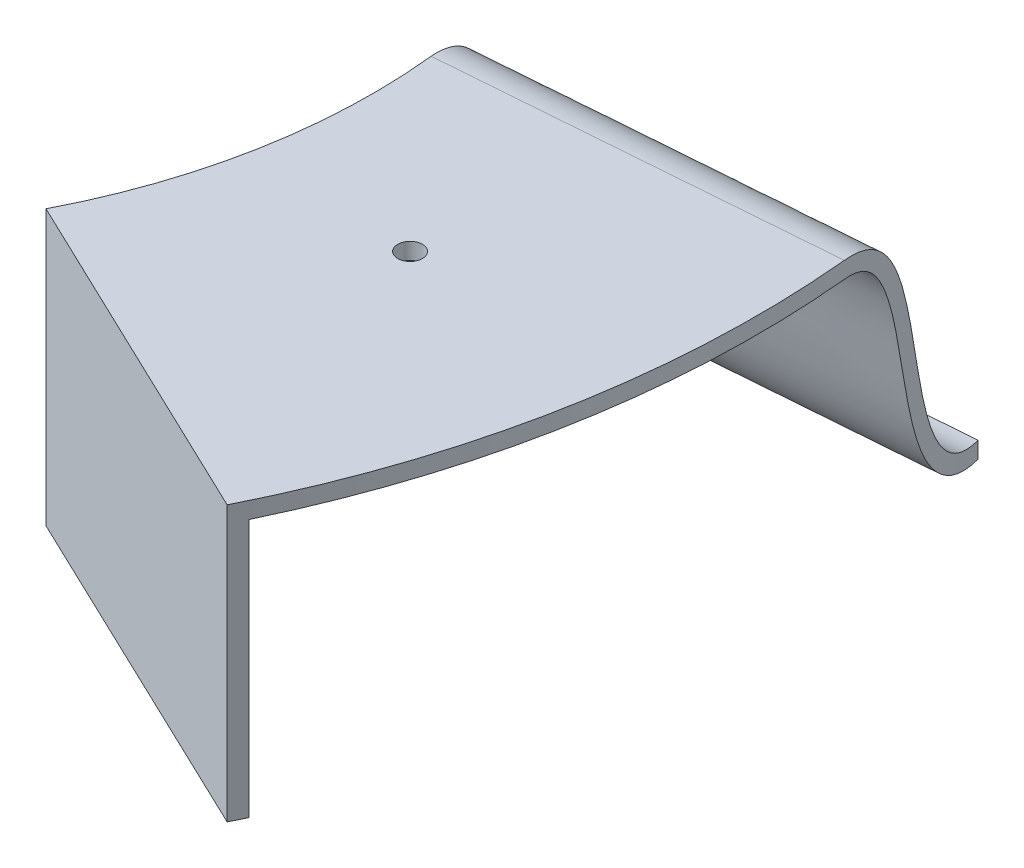
ISO-10303-21;
HEADER;
FILE_DESCRIPTION(('STEP AP214'),'2;1');
FILE_NAME('part.step','',(''),(''),'','','');
FILE_SCHEMA(('AUTOMOTIVE_DESIGN { 1 0 10303 214 1 1 1 1 }'));
ENDSEC;
DATA;
#1=APPLICATION_CONTEXT('core data for automotive mechanical design processes');
#2=APPLICATION_PROTOCOL_DEFINITION('international standard','automotive_design',2000,#1);
#3=PRODUCT_CONTEXT('',#1,'mechanical');
#4=PRODUCT('Part','Part','',(#3));
#5=PRODUCT_RELATED_PRODUCT_CATEGORY('part','',(#4));
#6=PRODUCT_DEFINITION_FORMATION('','',#4);
#7=PRODUCT_DEFINITION_CONTEXT('part definition',#1,'design');
#8=PRODUCT_DEFINITION('design','',#6,#7);
#9=PRODUCT_DEFINITION_SHAPE('','',#8);
#10=(LENGTH_UNIT() NAMED_UNIT(*) SI_UNIT(.MILLI.,.METRE.));
#11=(NAMED_UNIT(*) PLANE_ANGLE_UNIT() SI_UNIT($,.RADIAN.));
#12=(NAMED_UNIT(*) SI_UNIT($,.STERADIAN.) SOLID_ANGLE_UNIT());
#13=UNCERTAINTY_MEASURE_WITH_UNIT(LENGTH_MEASURE(1.E-05),#10,'distance_accuracy_value','');
#14=(GEOMETRIC_REPRESENTATION_CONTEXT(3) GLOBAL_UNCERTAINTY_ASSIGNED_CONTEXT((#13)) GLOBAL_UNIT_ASSIGNED_CONTEXT((#10,
#11,#12)) REPRESENTATION_CONTEXT('',''));
#15=CARTESIAN_POINT('',(0.,0.,0.));
#16=DIRECTION('',(0.,0.,1.));
#17=DIRECTION('',(1.,0.,0.));
#18=AXIS2_PLACEMENT_3D('',#15,#16,#17);
#19=CARTESIAN_POINT('',(0.,-60.,0.));
#20=DIRECTION('',(0.,1.,0.));
#21=DIRECTION('',(0.,0.,1.));
#22=AXIS2_PLACEMENT_3D('',#19,#20,#21);
#23=CYLINDRICAL_SURFACE('',#22,108.);
#24=CARTESIAN_POINT('',(0.,-60.,0.));
#25=DIRECTION('',(0.,1.,0.));
#26=DIRECTION('',(0.,0.,1.));
#27=AXIS2_PLACEMENT_3D('',#24,#25,#26);
#28=CIRCLE('',#27,108.);
#29=CARTESIAN_POINT('',(97.4441274393781,-60.,46.5686807584051));
#30=VERTEX_POINT('',#29);
#31=CARTESIAN_POINT('',(107.398759189683,-60.,-11.3800933439276));
#32=VERTEX_POINT('',#31);
#33=EDGE_CURVE('E174',#30,#32,#28,.T.);
#34=ORIENTED_EDGE('',*,*,#33,.T.);
#35=DIRECTION('',(0.,-1.,0.));
#36=VECTOR('',#35,1.);
#37=CARTESIAN_POINT('',(107.398759189683,-9.99999999999999,-11.3800933439276));
#38=LINE('',#37,#36);
#39=CARTESIAN_POINT('',(107.398759189683,-13.,-11.3800933439276));
#40=VERTEX_POINT('',#39);
#41=EDGE_CURVE('E162',#40,#32,#38,.T.);
#42=ORIENTED_EDGE('',*,*,#41,.F.);
#43=CARTESIAN_POINT('',(0.,-13.,0.));
#44=DIRECTION('',(0.,1.,0.));
#45=DIRECTION('',(0.,0.,1.));
#46=AXIS2_PLACEMENT_3D('',#43,#44,#45);
#47=CIRCLE('',#46,108.);
#48=CARTESIAN_POINT('',(97.4441274393781,-13.,46.5686807584051));
#49=VERTEX_POINT('',#48);
#50=EDGE_CURVE('E173',#49,#40,#47,.T.);
#51=ORIENTED_EDGE('',*,*,#50,.F.);
#52=DIRECTION('',(0.,1.,0.));
#53=VECTOR('',#52,1.);
#54=CARTESIAN_POINT('',(97.4441274393781,-60.,46.5686807584051));
#55=LINE('',#54,#53);
#56=EDGE_CURVE('E198',#30,#49,#55,.T.);
#57=ORIENTED_EDGE('',*,*,#56,.F.);
#58=EDGE_LOOP('',(#34,#42,#51,#57));
#59=FACE_BOUND('',#58,.T.);
#60=ADVANCED_FACE('F39',(#59),#23,.T.);
#61=CARTESIAN_POINT('',(0.,-60.,0.));
#62=DIRECTION('',(-0.431191488503751,0.,0.902260439253501));
#63=DIRECTION('',(0.902260439253501,0.,0.431191488503751));
#64=AXIS2_PLACEMENT_3D('',#61,#62,#63);
#65=PLANE('',#64);
#66=DIRECTION('',(-0.902260439253501,0.,-0.431191488503751));
#67=VECTOR('',#66,1.);
#68=CARTESIAN_POINT('',(0.,-13.,0.));
#69=LINE('',#68,#67);
#70=CARTESIAN_POINT('',(157.895576869363,-13.,75.4585104881564));
#71=VERTEX_POINT('',#70);
#72=EDGE_CURVE('E170',#71,#49,#69,.T.);
#73=ORIENTED_EDGE('',*,*,#72,.F.);
#74=DIRECTION('',(0.,1.,0.));
#75=VECTOR('',#74,1.);
#76=CARTESIAN_POINT('',(157.895576869363,-60.,75.4585104881564));
#77=LINE('',#76,#75);
#78=CARTESIAN_POINT('',(157.895576869363,-60.,75.4585104881564));
#79=VERTEX_POINT('',#78);
#80=EDGE_CURVE('E202',#79,#71,#77,.T.);
#81=ORIENTED_EDGE('',*,*,#80,.F.);
#82=DIRECTION('',(0.902260439253501,0.,0.431191488503751));
#83=VECTOR('',#82,1.);
#84=CARTESIAN_POINT('',(0.,-60.,0.));
#85=LINE('',#84,#83);
#86=EDGE_CURVE('E189',#30,#79,#85,.T.);
#87=ORIENTED_EDGE('',*,*,#86,.F.);
#88=ORIENTED_EDGE('',*,*,#56,.T.);
#89=EDGE_LOOP('',(#73,#81,#87,#88));
#90=FACE_BOUND('',#89,.T.);
#91=ADVANCED_FACE('F245',(#90),#65,.F.);
#92=CARTESIAN_POINT('',(0.,-60.,0.));
#93=DIRECTION('',(0.,1.,0.));
#94=DIRECTION('',(0.,0.,1.));
#95=AXIS2_PLACEMENT_3D('',#92,#93,#94);
#96=CYLINDRICAL_SURFACE('',#95,175.);
#97=CARTESIAN_POINT('',(0.,-10.,0.));
#98=DIRECTION('',(0.,1.,0.));
#99=DIRECTION('',(0.,0.,1.));
#100=AXIS2_PLACEMENT_3D('',#97,#98,#99);
#101=CIRCLE('',#100,175.);
#102=CARTESIAN_POINT('',(156.578799716315,-10.,78.1542032100517));
#103=VERTEX_POINT('',#102);
#104=CARTESIAN_POINT('',(174.212075233309,-10.,-16.5877316985724));
#105=VERTEX_POINT('',#104);
#106=EDGE_CURVE('E178',#103,#105,#101,.T.);
#107=ORIENTED_EDGE('',*,*,#106,.F.);
#108=DIRECTION('',(0.,1.,0.));
#109=VECTOR('',#108,1.);
#110=CARTESIAN_POINT('',(156.578799716315,-60.,78.1542032100517));
#111=LINE('',#110,#109);
#112=CARTESIAN_POINT('',(156.578799716315,-60.,78.1542032100517));
#113=VERTEX_POINT('',#112);
#114=EDGE_CURVE('E205',#113,#103,#111,.T.);
#115=ORIENTED_EDGE('',*,*,#114,.F.);
#116=CARTESIAN_POINT('',(0.,-60.,0.));
#117=DIRECTION('',(0.,1.,0.));
#118=DIRECTION('',(0.,0.,1.));
#119=AXIS2_PLACEMENT_3D('',#116,#117,#118);
#120=CIRCLE('',#119,175.);
#121=EDGE_CURVE('E186',#113,#79,#120,.T.);
#122=ORIENTED_EDGE('',*,*,#121,.T.);
#123=ORIENTED_EDGE('',*,*,#80,.T.);
#124=CARTESIAN_POINT('',(0.,-13.,0.));
#125=DIRECTION('',(0.,1.,0.));
#126=DIRECTION('',(0.,0.,1.));
#127=AXIS2_PLACEMENT_3D('',#124,#125,#126);
#128=CIRCLE('',#127,175.);
#129=CARTESIAN_POINT('',(174.212075233309,-13.,-16.5877316985724));
#130=VERTEX_POINT('',#129);
#131=EDGE_CURVE('E167',#130,#71,#128,.F.);
#132=ORIENTED_EDGE('',*,*,#131,.F.);
#133=CARTESIAN_POINT('',(168.736054114403,-59.,-46.4019831677623));
#134=CARTESIAN_POINT('',(168.765743413753,-58.9999944229445,-46.2940211639735));
#135=CARTESIAN_POINT('',(168.795328182611,-58.9989412248589,-46.1860337783242));
#136=CARTESIAN_POINT('',(168.854281022557,-58.9947217350341,-45.9700371209772));
#137=CARTESIAN_POINT('',(168.883649085991,-58.9915553690078,-45.8620278486434));
#138=CARTESIAN_POINT('',(168.971508039527,-58.97884619479,-45.5376734168448));
#139=CARTESIAN_POINT('',(169.029657832277,-58.9660932023859,-45.3213502325253));
#140=CARTESIAN_POINT('',(169.144989943779,-58.9313358777362,-44.8890017320752));
#141=CARTESIAN_POINT('',(169.202171457153,-58.909324203219,-44.6729767891598));
#142=CARTESIAN_POINT('',(169.315428879099,-58.8556724226418,-44.2417816179056));
#143=CARTESIAN_POINT('',(169.371504563544,-58.8240303856438,-44.0266115697506));
#144=CARTESIAN_POINT('',(169.482481429487,-58.7508434250989,-43.5974500609822));
#145=CARTESIAN_POINT('',(169.537381565424,-58.7092900548627,-43.3834597658037));
#146=CARTESIAN_POINT('',(169.645821974475,-58.615982374438,-42.9574600603129));
#147=CARTESIAN_POINT('',(169.699362808591,-58.5642323524239,-42.7454498564017));
#148=CARTESIAN_POINT('',(169.804969887496,-58.4502224580249,-42.3239810844225));
#149=CARTESIAN_POINT('',(169.857036668277,-58.3879664646378,-42.1145216050727));
#150=CARTESIAN_POINT('',(169.9595875189,-58.2526831392078,-41.6987346616385));
#151=CARTESIAN_POINT('',(170.010071688205,-58.1796564857224,-41.4924070011504));
#152=CARTESIAN_POINT('',(170.122707943943,-58.0019294576496,-41.0284715690253));
#153=CARTESIAN_POINT('',(170.184352260791,-57.8939898762927,-40.7719739062442));
#154=CARTESIAN_POINT('',(170.304791586222,-57.6613476356402,-40.2659364958718));
#155=CARTESIAN_POINT('',(170.363585888613,-57.5366408502751,-40.0163984792163));
#156=CARTESIAN_POINT('',(170.478161374237,-57.2709664601344,-39.5254353116069));
#157=CARTESIAN_POINT('',(170.533942739079,-57.129999837053,-39.2840096720003));
#158=CARTESIAN_POINT('',(170.642215567656,-56.8328083750086,-38.8109901908186));
#159=CARTESIAN_POINT('',(170.694716140816,-56.6766291754985,-38.5793697598994));
#160=CARTESIAN_POINT('',(170.796493403555,-56.3492627650161,-38.1262610889518));
#161=CARTESIAN_POINT('',(170.845770220405,-56.1780761471457,-37.9047724490351));
#162=CARTESIAN_POINT('',(170.941097234578,-55.8218761074723,-37.4725267551005));
#163=CARTESIAN_POINT('',(170.987147444379,-55.6368627391512,-37.2617696595784));
#164=CARTESIAN_POINT('',(171.104499296366,-55.1320451722014,-36.7201421675965));
#165=CARTESIAN_POINT('',(171.173144404566,-54.8016209948918,-36.398526761172));
#166=CARTESIAN_POINT('',(171.30241679036,-54.1127834998765,-35.7851970569971));
#167=CARTESIAN_POINT('',(171.363042491651,-53.7543647014776,-35.4934886403192));
#168=CARTESIAN_POINT('',(171.477099672368,-53.0136246765197,-34.9383005013085));
#169=CARTESIAN_POINT('',(171.530509027702,-52.6312349805478,-34.6749080737547));
#170=CARTESIAN_POINT('',(171.630695154083,-51.8482331346587,-34.1755671933182));
#171=CARTESIAN_POINT('',(171.677472169646,-51.4476216572448,-33.9396177287514));
#172=CARTESIAN_POINT('',(171.746416384116,-50.807612138955,-33.5884690571207));
#173=CARTESIAN_POINT('',(171.77052103547,-50.5729148852636,-33.4649516651766));
#174=CARTESIAN_POINT('',(171.81704244635,-50.0996163696286,-33.2252741601996));
#175=CARTESIAN_POINT('',(171.839459165449,-49.8610150143426,-33.109114223399));
#176=CARTESIAN_POINT('',(171.882754518314,-49.3802164090303,-32.8836112873878));
#177=CARTESIAN_POINT('',(171.903631731635,-49.1380160798731,-32.7742745976817));
#178=CARTESIAN_POINT('',(171.943943027721,-48.6506679854246,-32.5621266814758));
#179=CARTESIAN_POINT('',(171.96337712669,-48.4055202532628,-32.4593153817103));
#180=CARTESIAN_POINT('',(172.019738087475,-47.6656756101905,-32.1597759073859));
#181=CARTESIAN_POINT('',(172.054676412392,-47.1671089910952,-31.972188830084));
#182=CARTESIAN_POINT('',(172.120146647863,-46.162355335888,-31.6178353200896));
#183=CARTESIAN_POINT('',(172.150677879264,-45.6561671385039,-31.4510720969726));
#184=CARTESIAN_POINT('',(172.20830148355,-44.6354260907734,-31.1340166451233));
#185=CARTESIAN_POINT('',(172.235373925053,-44.1208424776483,-30.9838205077474));
#186=CARTESIAN_POINT('',(172.286600132353,-43.0881286532848,-30.6976952943684));
#187=CARTESIAN_POINT('',(172.31075656031,-42.5700021402919,-30.561753220319));
#188=CARTESIAN_POINT('',(172.356823067899,-41.5310866483851,-30.3008753234559));
#189=CARTESIAN_POINT('',(172.378733876888,-41.0102985919832,-30.1759359289302));
#190=CARTESIAN_POINT('',(172.42076918116,-39.9666899509208,-29.9348176092459));
#191=CARTESIAN_POINT('',(172.440893840165,-39.4438695571442,-29.8186378813027));
#192=CARTESIAN_POINT('',(172.488761950631,-38.1547778753343,-29.5407374122955));
#193=CARTESIAN_POINT('',(172.515727729142,-37.3876702873379,-29.382786230552));
#194=CARTESIAN_POINT('',(172.567898576197,-35.8517154813369,-29.0748125564508));
#195=CARTESIAN_POINT('',(172.593103382362,-35.0828680216411,-28.924791246425));
#196=CARTESIAN_POINT('',(172.642832863669,-33.5446349682105,-28.6264756754857));
#197=CARTESIAN_POINT('',(172.667357378758,-32.7752492907749,-28.478181825676));
#198=CARTESIAN_POINT('',(172.716574127169,-31.2407565130038,-28.1781493063424));
#199=CARTESIAN_POINT('',(172.741265099465,-30.4756458053807,-28.0264292603614));
#200=CARTESIAN_POINT('',(172.779228977755,-29.3296754085066,-27.7910826406198));
#201=CARTESIAN_POINT('',(172.792036872263,-28.948005235257,-27.7113475427688));
#202=CARTESIAN_POINT('',(172.818096708589,-28.1854331390192,-27.5483626105324));
#203=CARTESIAN_POINT('',(172.831348645027,-27.8045312067811,-27.4651128187329));
#204=CARTESIAN_POINT('',(172.858436288177,-27.0438485313169,-27.2941109964043));
#205=CARTESIAN_POINT('',(172.872271858473,-26.6640675480474,-27.2063600169389));
#206=CARTESIAN_POINT('',(172.900688937966,-25.9058957462008,-27.0251767681108));
#207=CARTESIAN_POINT('',(172.915270426491,-25.5275048894106,-26.9317446561746));
#208=CARTESIAN_POINT('',(172.94609958583,-24.7538476586615,-26.7330739624808));
#209=CARTESIAN_POINT('',(172.962394013438,-24.3586739397993,-26.6274797882809));
#210=CARTESIAN_POINT('',(172.996192343236,-23.5709327142297,-26.4070045223429));
#211=CARTESIAN_POINT('',(173.013696327781,-23.1783653869847,-26.292122798144));
#212=CARTESIAN_POINT('',(173.050197229358,-22.3957493737283,-26.0508000878769));
#213=CARTESIAN_POINT('',(173.06919784011,-22.0057096647329,-25.9243303683117));
#214=CARTESIAN_POINT('',(173.108944446199,-21.2304449449107,-25.6575831595461));
#215=CARTESIAN_POINT('',(173.129690336421,-20.8452196457201,-25.5173065018365));
#216=CARTESIAN_POINT('',(173.166092168046,-20.2064357660702,-25.2688479089243));
#217=CARTESIAN_POINT('',(173.181189479885,-19.9510807072629,-25.1652037463426));
#218=CARTESIAN_POINT('',(173.212419501763,-19.4440419798025,-24.9493416139874));
#219=CARTESIAN_POINT('',(173.228552285186,-19.1923585729104,-24.8371230364459));
#220=CARTESIAN_POINT('',(173.261999601331,-18.693592598146,-24.6027136682047));
#221=CARTESIAN_POINT('',(173.27931467093,-18.4465121861918,-24.4805183420654));
#222=CARTESIAN_POINT('',(173.315212312112,-17.9588816474279,-24.2250651722953));
#223=CARTESIAN_POINT('',(173.333792063269,-17.7183185605106,-24.0918318096667));
#224=CARTESIAN_POINT('',(173.372348389261,-17.2447822076046,-23.8127835473512));
#225=CARTESIAN_POINT('',(173.392324519792,-17.0118065616983,-23.6669726461952));
#226=CARTESIAN_POINT('',(173.433789070318,-16.5556519894974,-23.3611777740535));
#227=CARTESIAN_POINT('',(173.455276334648,-16.3324657841743,-23.2012046101794));
#228=CARTESIAN_POINT('',(173.495688386856,-15.9397501817837,-22.8968335293693));
#229=CARTESIAN_POINT('',(173.514329995366,-15.7680517557035,-22.7552058145035));
#230=CARTESIAN_POINT('',(173.552743520778,-15.4350221654548,-22.4603499261895));
#231=CARTESIAN_POINT('',(173.572515286906,-15.273689624449,-22.3071232992675));
#232=CARTESIAN_POINT('',(173.613096871169,-14.9642209217224,-21.9890470867718));
#233=CARTESIAN_POINT('',(173.633902643014,-14.8160388036669,-21.8242419015956));
#234=CARTESIAN_POINT('',(173.676515482071,-14.5344466904292,-21.4824950082557));
#235=CARTESIAN_POINT('',(173.698322543578,-14.4010366111128,-21.3055533692245));
#236=CARTESIAN_POINT('',(173.735485951625,-14.1920898415547,-20.9999111617005));
#237=CARTESIAN_POINT('',(173.750620368123,-14.1118921038662,-20.8743516928376));
#238=CARTESIAN_POINT('',(173.781190606361,-13.9598200821993,-20.618302606383));
#239=CARTESIAN_POINT('',(173.796626443783,-13.8879462326453,-20.4878127319439));
#240=CARTESIAN_POINT('',(173.827696398054,-13.7527868427682,-20.2225074430829));
#241=CARTESIAN_POINT('',(173.84333048664,-13.6895000930139,-20.0876926411097));
#242=CARTESIAN_POINT('',(173.874782232359,-13.5715838871593,-19.8136116915186));
#243=CARTESIAN_POINT('',(173.890600401572,-13.5169952462091,-19.6743280413988));
#244=CARTESIAN_POINT('',(173.922246916261,-13.416746052129,-19.392579190454));
#245=CARTESIAN_POINT('',(173.938075262707,-13.371086539773,-19.2501136209003));
#246=CARTESIAN_POINT('',(173.969640501534,-13.288353054132,-18.962728614512));
#247=CARTESIAN_POINT('',(173.985377405474,-13.2512779715945,-18.8178094973168));
#248=CARTESIAN_POINT('',(174.013286236834,-13.192474846068,-18.5577320971461));
#249=CARTESIAN_POINT('',(174.025491589595,-13.1691621304165,-18.4429310753661));
#250=CARTESIAN_POINT('',(174.049761112292,-13.1273184033523,-18.212470389065));
#251=CARTESIAN_POINT('',(174.061825308943,-13.1087864727053,-18.0968108940147));
#252=CARTESIAN_POINT('',(174.085787861299,-13.0762922864783,-17.8648276095892));
#253=CARTESIAN_POINT('',(174.097686202774,-13.0623304206992,-17.748503764409));
#254=CARTESIAN_POINT('',(174.121199269643,-13.0389726856026,-17.5163200868029));
#255=CARTESIAN_POINT('',(174.132815502375,-13.0295411862933,-17.4004639855789));
#256=CARTESIAN_POINT('',(174.150083387733,-13.0183943785455,-17.2264869872486));
#257=CARTESIAN_POINT('',(174.155813082167,-13.0151789071906,-17.1684644679613));
#258=CARTESIAN_POINT('',(174.167218778312,-13.0096748339425,-17.0523694716721));
#259=CARTESIAN_POINT('',(174.172894779859,-13.0073862349015,-16.994296994517));
#260=CARTESIAN_POINT('',(174.184188083186,-13.0037137627497,-16.8781522696157));
#261=CARTESIAN_POINT('',(174.189805417387,-13.0023293607421,-16.8200800416404));
#262=CARTESIAN_POINT('',(174.200983258139,-13.0004754627714,-16.7039168269503));
#263=CARTESIAN_POINT('',(174.206543765927,-13.0000059468496,-16.6458258406725));
#264=CARTESIAN_POINT('',(174.212075233309,-13.,-16.5877316985725));
#265=B_SPLINE_CURVE_WITH_KNOTS('',3,(#133,#134,#135,#136,#137,#138,#139,#140,#141,#142,#143,
#144,#145,#146,#147,#148,#149,#150,#151,#152,#153,#154,#155,#156,#157,#158,#159,#160,#161,#162,
#163,#164,#165,#166,#167,#168,#169,#170,#171,#172,#173,#174,#175,#176,#177,#178,#179,#180,#181,
#182,#183,#184,#185,#186,#187,#188,#189,#190,#191,#192,#193,#194,#195,#196,#197,#198,#199,#200,
#201,#202,#203,#204,#205,#206,#207,#208,#209,#210,#211,#212,#213,#214,#215,#216,#217,#218,#219,
#220,#221,#222,#223,#224,#225,#226,#227,#228,#229,#230,#231,#232,#233,#234,#235,#236,#237,#238,
#239,#240,#241,#242,#243,#244,#245,#246,#247,#248,#249,#250,#251,#252,#253,#254,#255,#256,#257,
#258,#259,#260,#261,#262,#263,#264),.UNSPECIFIED.,.F.,.F.,(4,2,2,2,2,2,2,2,2,2,2,2,2,2,2,2,2,2,
2,2,2,2,2,2,2,2,2,2,2,2,2,2,2,2,2,2,2,2,2,2,2,2,2,2,2,2,2,2,2,2,2,2,2,2,2,2,2,2,2,2,2,2,2,2,2,
4),(0.,0.335898036009482,0.671807880918241,1.34471146889437,2.0181496884021,2.69172302483718,
3.36587246154598,4.03973898933009,4.71335725539945,5.38693310125832,6.24141150792798,
7.09610057059343,7.95073805804738,8.80288619441925,9.65500066857,10.5071118469142,
11.9034412469658,13.3000447042474,14.7008371948551,16.1015780289085,16.9003864005141,
17.6992138986625,18.4987694549376,19.298316032384,20.899171198666,22.5002728006124,
24.1102203630813,25.7186868341098,27.3266292218377,28.9344240692093,31.2853228517782,
33.6365711667566,35.9883680510021,38.3295233862589,39.4998715181473,40.6702054735558,
41.8402673796901,43.0102968777219,44.2382906011769,45.4663680187417,46.6975775258875,
47.9287129316235,48.7565846587542,49.5845151212813,50.4128240801438,51.2393427589545,
52.0655996404683,52.8912313588865,53.5608274669627,54.2303344520209,54.8974011397988,
55.5644640280986,56.0134394991552,56.4624383917314,56.9113739802576,57.3623577812651,
57.8133941173829,58.2643721394658,58.617606945246,58.970773781452,59.3239707329623,
59.6743424683916,59.849516554099,60.0246911788735,60.1997632458543,60.374831493513),.UNSPECIFIED.);
#266=CARTESIAN_POINT('',(168.736054114323,-59.,-46.4019831677561));
#267=VERTEX_POINT('',#266);
#268=EDGE_CURVE('E158',#267,#130,#265,.T.);
#269=ORIENTED_EDGE('',*,*,#268,.F.);
#270=DIRECTION('',(0.,-1.,0.));
#271=VECTOR('',#270,1.);
#272=CARTESIAN_POINT('',(168.736054114291,62.9999999998873,-46.4019831681695));
#273=LINE('',#272,#271);
#274=CARTESIAN_POINT('',(168.736054114291,-56.,-46.4019831681695));
#275=VERTEX_POINT('',#274);
#276=EDGE_CURVE('E156',#275,#267,#273,.T.);
#277=ORIENTED_EDGE('',*,*,#276,.F.);
#278=CARTESIAN_POINT('',(174.212075233309,-10.,-16.5877316985724));
#279=CARTESIAN_POINT('',(174.192212562913,-9.9999975333336,-16.7963522776043));
#280=CARTESIAN_POINT('',(174.17196939404,-10.0045074448612,-17.0049709310562));
#281=CARTESIAN_POINT('',(174.130746512098,-10.0232220690693,-17.4220256289478));
#282=CARTESIAN_POINT('',(174.109765694379,-10.0374419651918,-17.6304608747396));
#283=CARTESIAN_POINT('',(174.067145103751,-10.0762593816334,-18.0464053988414));
#284=CARTESIAN_POINT('',(174.045505041821,-10.1008615162421,-18.253914223921));
#285=CARTESIAN_POINT('',(174.00159632298,-10.1611345735875,-18.6678304776354));
#286=CARTESIAN_POINT('',(173.979326150878,-10.1968346852748,-18.874233524415));
#287=CARTESIAN_POINT('',(173.934320978921,-10.2797977848611,-19.284568092641));
#288=CARTESIAN_POINT('',(173.911586187503,-10.3270556877276,-19.4885006597137));
#289=CARTESIAN_POINT('',(173.865763985733,-10.4335426456909,-19.893153780946));
#290=CARTESIAN_POINT('',(173.842676627848,-10.4927699352687,-20.0938748041109));
#291=CARTESIAN_POINT('',(173.796076926781,-10.6240185196662,-20.4930323222018));
#292=CARTESIAN_POINT('',(173.772562631575,-10.6961478379999,-20.6914331581418));
#293=CARTESIAN_POINT('',(173.725456729832,-10.8529007736548,-21.0832785691892));
#294=CARTESIAN_POINT('',(173.701865108911,-10.93752686139,-21.2767221554332));
#295=CARTESIAN_POINT('',(173.65476897411,-11.1190753969334,-21.65774836085));
#296=CARTESIAN_POINT('',(173.631264454689,-11.2159970482829,-21.8453313586689));
#297=CARTESIAN_POINT('',(173.584572939941,-11.4214009193667,-22.2132916640982));
#298=CARTESIAN_POINT('',(173.561385165545,-11.5298448836817,-22.3936902416297));
#299=CARTESIAN_POINT('',(173.515393415502,-11.7579557149889,-22.7473085267199));
#300=CARTESIAN_POINT('',(173.492589459685,-11.8776231597522,-22.9205278640374));
#301=CARTESIAN_POINT('',(173.447495815787,-12.1273973272403,-23.2593078767754));
#302=CARTESIAN_POINT('',(173.425206127447,-12.2575040447234,-23.4248685560413));
#303=CARTESIAN_POINT('',(173.366369469493,-12.6186256588129,-23.8574250570052));
#304=CARTESIAN_POINT('',(173.330378477169,-12.8583608244373,-24.1172717485346));
#305=CARTESIAN_POINT('',(173.260490733683,-13.3604046367765,-24.6143338037089));
#306=CARTESIAN_POINT('',(173.22659440517,-13.6227178137613,-24.851544605242));
#307=CARTESIAN_POINT('',(173.160939308925,-14.1666184690303,-25.3049752921493));
#308=CARTESIAN_POINT('',(173.129188388768,-14.4482698331433,-25.5211192720175));
#309=CARTESIAN_POINT('',(173.067972915043,-15.0262321611576,-25.9329914013317));
#310=CARTESIAN_POINT('',(173.038508317374,-15.3225428421177,-26.128719944592));
#311=CARTESIAN_POINT('',(172.968104284143,-16.0723640492271,-26.5916035968869));
#312=CARTESIAN_POINT('',(172.92847902544,-16.5328069763614,-26.8477158428177));
#313=CARTESIAN_POINT('',(172.853541681677,-17.4718214437917,-27.326024615963));
#314=CARTESIAN_POINT('',(172.818235687865,-17.9504173670325,-27.5481733538066));
#315=CARTESIAN_POINT('',(172.75138748375,-18.9202336124392,-27.9643075938162));
#316=CARTESIAN_POINT('',(172.719847937081,-19.4114625737982,-28.1582731856123));
#317=CARTESIAN_POINT('',(172.6598390864,-20.4049955899766,-28.5239267696736));
#318=CARTESIAN_POINT('',(172.631385719375,-20.9073423685692,-28.6954999749349));
#319=CARTESIAN_POINT('',(172.577210400418,-21.9177537939204,-29.0195341592226));
#320=CARTESIAN_POINT('',(172.551486033878,-22.4258129386072,-29.1720120556236));
#321=CARTESIAN_POINT('',(172.50225774468,-23.4461791779169,-29.4617146246514));
#322=CARTESIAN_POINT('',(172.478753215087,-23.958485069506,-29.5989434684064));
#323=CARTESIAN_POINT('',(172.43548588794,-24.9414976799546,-29.8499236801101));
#324=CARTESIAN_POINT('',(172.415575480139,-25.4119438863999,-29.9646788862836));
#325=CARTESIAN_POINT('',(172.376926609098,-26.3547644763935,-30.1862188880077));
#326=CARTESIAN_POINT('',(172.358188187885,-26.8271389284429,-30.2930033977536));
#327=CARTESIAN_POINT('',(172.321593168941,-27.7734478854083,-30.500485758687));
#328=CARTESIAN_POINT('',(172.303736929763,-28.2473829424862,-30.6011811386736));
#329=CARTESIAN_POINT('',(172.268646147121,-29.1962056423354,-30.7981089282203));
#330=CARTESIAN_POINT('',(172.251411613449,-29.6710932999873,-30.8943412674878));
#331=CARTESIAN_POINT('',(172.200237816915,-31.0970511076597,-31.1787671899314));
#332=CARTESIAN_POINT('',(172.166843932382,-32.0490008857362,-31.3626015682133));
#333=CARTESIAN_POINT('',(172.099617014017,-33.9487382210685,-31.7294254094329));
#334=CARTESIAN_POINT('',(172.065786529394,-34.8965258310458,-31.9124150618809));
#335=CARTESIAN_POINT('',(172.012983009876,-36.3162429093217,-32.1953836970249));
#336=CARTESIAN_POINT('',(171.99504302099,-36.7890513220907,-32.2910987341993));
#337=CARTESIAN_POINT('',(171.958166856585,-37.7337194902475,-32.4869022762866));
#338=CARTESIAN_POINT('',(171.939230696798,-38.2055792604937,-32.5869907121322));
#339=CARTESIAN_POINT('',(171.900030440442,-39.1477848110637,-32.7931477138428));
#340=CARTESIAN_POINT('',(171.879766771841,-39.6181310285302,-32.8992143509057));
#341=CARTESIAN_POINT('',(171.837521250798,-40.5569083150427,-33.1191612302215));
#342=CARTESIAN_POINT('',(171.815539462753,-41.0253394551753,-33.233041179606));
#343=CARTESIAN_POINT('',(171.768752867743,-41.9729278238173,-33.474035482172));
#344=CARTESIAN_POINT('',(171.743885442364,-42.452010088761,-33.6014345902398));
#345=CARTESIAN_POINT('',(171.691282220116,-43.4064646116977,-33.8691931869544));
#346=CARTESIAN_POINT('',(171.663546116028,-43.8818364664513,-34.0095540635612));
#347=CARTESIAN_POINT('',(171.604427588839,-44.8288259774729,-34.3066096823386));
#348=CARTESIAN_POINT('',(171.573034545197,-45.300428223191,-34.4633518566052));
#349=CARTESIAN_POINT('',(171.505821196838,-46.2364367944425,-34.7962954333755));
#350=CARTESIAN_POINT('',(171.470001081449,-46.7008434267459,-34.9724960036939));
#351=CARTESIAN_POINT('',(171.392422500354,-47.6253377806787,-35.3507469742711));
#352=CARTESIAN_POINT('',(171.35059627472,-48.085301691325,-35.5530892547858));
#353=CARTESIAN_POINT('',(171.260031118979,-48.9909637118767,-35.9868156720222));
#354=CARTESIAN_POINT('',(171.211290289982,-49.4366578616675,-36.2182077844049));
#355=CARTESIAN_POINT('',(171.105576967854,-50.3060674400305,-36.7143802066102));
#356=CARTESIAN_POINT('',(171.048635338514,-50.7298575211788,-36.9790348770057));
#357=CARTESIAN_POINT('',(170.924760936181,-51.5487544967604,-37.5474452518321));
#358=CARTESIAN_POINT('',(170.857837559399,-51.9438878525027,-37.8511641469477));
#359=CARTESIAN_POINT('',(170.741612322331,-52.5444864793578,-38.3711023244236));
#360=CARTESIAN_POINT('',(170.695985629222,-52.7625411732661,-38.573657021359));
#361=CARTESIAN_POINT('',(170.600356955795,-53.1820021752978,-38.9944197762811));
#362=CARTESIAN_POINT('',(170.550355532337,-53.3834105959946,-39.2126258413721));
#363=CARTESIAN_POINT('',(170.445940845741,-53.7666484417041,-39.6640237878045));
#364=CARTESIAN_POINT('',(170.391535048551,-53.948509831483,-39.8971901759209));
#365=CARTESIAN_POINT('',(170.278271911994,-54.290672121461,-40.3778534270939));
#366=CARTESIAN_POINT('',(170.219414659469,-54.4509734421045,-40.6253500105618));
#367=CARTESIAN_POINT('',(170.097259723652,-54.7486448840495,-41.1338154526269));
#368=CARTESIAN_POINT('',(170.033948843004,-54.8859423920064,-41.3948236899147));
#369=CARTESIAN_POINT('',(169.903402552717,-55.1359464278338,-41.9274249958977));
#370=CARTESIAN_POINT('',(169.836166907108,-55.2486514751951,-42.1990187006972));
#371=CARTESIAN_POINT('',(169.698046859442,-55.4495737838346,-42.7510706598808));
#372=CARTESIAN_POINT('',(169.627153066009,-55.5377238781773,-43.0315509359018));
#373=CARTESIAN_POINT('',(169.482411077102,-55.6898091485722,-43.598140894627));
#374=CARTESIAN_POINT('',(169.40856327051,-55.7537475004684,-43.8842498338391));
#375=CARTESIAN_POINT('',(169.237071181142,-55.8736651201025,-44.5416586194816));
#376=CARTESIAN_POINT('',(169.138616962129,-55.9222465494107,-44.9141103924711));
#377=CARTESIAN_POINT('',(168.988893163538,-55.9695933931718,-45.4729704092411));
#378=CARTESIAN_POINT('',(168.938792540385,-55.9811245965236,-45.6587502633504));
#379=CARTESIAN_POINT('',(168.837916288437,-55.9963239046713,-46.0303710803967));
#380=CARTESIAN_POINT('',(168.78714094149,-55.999995194904,-46.2162119880373));
#381=CARTESIAN_POINT('',(168.7360541144,-56.,-46.4019831677723));
#382=B_SPLINE_CURVE_WITH_KNOTS('',3,(#278,#279,#280,#281,#282,#283,#284,#285,#286,#287,#288,
#289,#290,#291,#292,#293,#294,#295,#296,#297,#298,#299,#300,#301,#302,#303,#304,#305,#306,#307,
#308,#309,#310,#311,#312,#313,#314,#315,#316,#317,#318,#319,#320,#321,#322,#323,#324,#325,#326,
#327,#328,#329,#330,#331,#332,#333,#334,#335,#336,#337,#338,#339,#340,#341,#342,#343,#344,#345,
#346,#347,#348,#349,#350,#351,#352,#353,#354,#355,#356,#357,#358,#359,#360,#361,#362,#363,#364,
#365,#366,#367,#368,#369,#370,#371,#372,#373,#374,#375,#376,#377,#378,#379,#380,#381),
.UNSPECIFIED.,.F.,.F.,(4,2,2,2,2,2,2,2,2,2,2,2,2,2,2,2,2,2,2,2,2,2,2,2,2,2,2,2,2,2,2,2,2,2,2,2,
2,2,2,2,2,2,2,2,2,2,2,2,2,2,2,4),(0.,0.628693998622209,1.25837334015449,1.88833283205218,
2.51996341156328,3.1513165935891,3.78257671708339,4.41939315598363,5.05633565238098,
5.6932369111681,6.32808601677364,6.96296782159624,7.59784930764575,8.66223219365241,
9.72682914780847,10.7951301658625,11.8634105725502,13.4465841841778,15.0319653420245,
16.6184611245597,18.2127943407492,19.8057049214009,21.3981787093469,22.8520404112992,
24.3059542192365,25.7604541745938,27.2149770304745,30.1252968273984,33.0229287715662,
34.4711112305036,35.9192708272026,37.3669658361198,38.8146066103469,40.3035208999612,
41.7925948093881,43.2861065085615,44.7795543588222,46.291412214866,47.8036860645041,
49.3104103800666,50.8157252051615,51.7182426832246,52.6206454466273,53.521549332194,
54.4224356466241,55.3261141863921,56.2298471141898,57.1360283415042,58.0420906641976,
59.2050742960987,59.7832335826334,60.3611585105067),.UNSPECIFIED.);
#383=EDGE_CURVE('E122',#105,#275,#382,.T.);
#384=ORIENTED_EDGE('',*,*,#383,.F.);
#385=EDGE_LOOP('',(#107,#115,#122,#123,#132,#269,#277,#384));
#386=FACE_BOUND('',#385,.T.);
#387=ADVANCED_FACE('F263',(#386),#96,.T.);
#388=CARTESIAN_POINT('',(-1.29357446551125,-60.,2.7067813177605));
#389=DIRECTION('',(-0.431191488503751,0.,0.902260439253501));
#390=DIRECTION('',(0.902260439253501,0.,0.431191488503751));
#391=AXIS2_PLACEMENT_3D('',#388,#389,#390);
#392=PLANE('',#391);
#393=DIRECTION('',(0.902260439253501,0.,0.431191488503751));
#394=VECTOR('',#393,1.);
#395=CARTESIAN_POINT('',(-1.29357446551125,-10.,2.7067813177605));
#396=LINE('',#395,#394);
#397=CARTESIAN_POINT('',(93.4050954568535,-10.,47.9634042025385));
#398=VERTEX_POINT('',#397);
#399=EDGE_CURVE('E194',#398,#103,#396,.T.);
#400=ORIENTED_EDGE('',*,*,#399,.F.);
#401=DIRECTION('',(0.,1.,0.));
#402=VECTOR('',#401,1.);
#403=CARTESIAN_POINT('',(93.4050954568535,-60.,47.9634042025385));
#404=LINE('',#403,#402);
#405=CARTESIAN_POINT('',(93.4050954568535,-60.,47.9634042025385));
#406=VERTEX_POINT('',#405);
#407=EDGE_CURVE('E207',#406,#398,#404,.T.);
#408=ORIENTED_EDGE('',*,*,#407,.F.);
#409=DIRECTION('',(0.902260439253501,0.,0.431191488503751));
#410=VECTOR('',#409,1.);
#411=CARTESIAN_POINT('',(-1.29357446551125,-60.,2.7067813177605));
#412=LINE('',#411,#410);
#413=EDGE_CURVE('E183',#406,#113,#412,.T.);
#414=ORIENTED_EDGE('',*,*,#413,.T.);
#415=ORIENTED_EDGE('',*,*,#114,.T.);
#416=EDGE_LOOP('',(#400,#408,#414,#415));
#417=FACE_BOUND('',#416,.T.);
#418=ADVANCED_FACE('F250',(#417),#392,.T.);
#419=CARTESIAN_POINT('',(0.,-60.,0.));
#420=DIRECTION('',(0.,1.,0.));
#421=DIRECTION('',(0.,0.,1.));
#422=AXIS2_PLACEMENT_3D('',#419,#420,#421);
#423=CYLINDRICAL_SURFACE('',#422,105.);
#424=CARTESIAN_POINT('',(0.,-10.,0.));
#425=DIRECTION('',(0.,1.,0.));
#426=DIRECTION('',(0.,0.,1.));
#427=AXIS2_PLACEMENT_3D('',#424,#425,#426);
#428=CIRCLE('',#427,105.);
#429=CARTESIAN_POINT('',(104.406642989694,-10.,-11.1468784698979));
#430=VERTEX_POINT('',#429);
#431=EDGE_CURVE('E192',#398,#430,#428,.T.);
#432=ORIENTED_EDGE('',*,*,#431,.T.);
#433=DIRECTION('',(0.,1.,0.));
#434=VECTOR('',#433,1.);
#435=CARTESIAN_POINT('',(104.406642989694,-60.,-11.1468784698979));
#436=LINE('',#435,#434);
#437=CARTESIAN_POINT('',(104.406642989694,-60.,-11.1468784698979));
#438=VERTEX_POINT('',#437);
#439=EDGE_CURVE('E55',#438,#430,#436,.T.);
#440=ORIENTED_EDGE('',*,*,#439,.F.);
#441=CARTESIAN_POINT('',(0.,-60.,0.));
#442=DIRECTION('',(0.,1.,0.));
#443=DIRECTION('',(0.,0.,1.));
#444=AXIS2_PLACEMENT_3D('',#441,#442,#443);
#445=CIRCLE('',#444,105.);
#446=EDGE_CURVE('E181',#406,#438,#445,.T.);
#447=ORIENTED_EDGE('',*,*,#446,.F.);
#448=ORIENTED_EDGE('',*,*,#407,.T.);
#449=EDGE_LOOP('',(#432,#440,#447,#448));
#450=FACE_BOUND('',#449,.T.);
#451=ADVANCED_FACE('F253',(#450),#423,.F.);
#452=CARTESIAN_POINT('',(0.,-60.,0.));
#453=DIRECTION('',(0.,1.,0.));
#454=DIRECTION('',(0.,0.,1.));
#455=AXIS2_PLACEMENT_3D('',#452,#453,#454);
#456=PLANE('',#455);
#457=ORIENTED_EDGE('',*,*,#33,.F.);
#458=ORIENTED_EDGE('',*,*,#86,.T.);
#459=ORIENTED_EDGE('',*,*,#121,.F.);
#460=ORIENTED_EDGE('',*,*,#413,.F.);
#461=ORIENTED_EDGE('',*,*,#446,.T.);
#462=DIRECTION('',(0.996976205475113,0.,-0.0777074366868773));
#463=VECTOR('',#462,1.);
#464=CARTESIAN_POINT('',(-0.233122310060635,-60.,-2.99092861642538));
#465=LINE('',#464,#463);
#466=EDGE_CURVE('E177',#438,#32,#465,.T.);
#467=ORIENTED_EDGE('',*,*,#466,.T.);
#468=EDGE_LOOP('',(#457,#458,#459,#460,#461,#467));
#469=FACE_BOUND('',#468,.T.);
#470=ADVANCED_FACE('F237',(#469),#456,.F.);
#471=CARTESIAN_POINT('',(0.,-10.,0.));
#472=DIRECTION('',(0.,1.,0.));
#473=DIRECTION('',(0.,0.,1.));
#474=AXIS2_PLACEMENT_3D('',#471,#472,#473);
#475=PLANE('',#474);
#476=CARTESIAN_POINT('',(133.270755037805,-10.,21.5384737540379));
#477=DIRECTION('',(0.,1.,0.));
#478=DIRECTION('',(0.,0.,1.));
#479=AXIS2_PLACEMENT_3D('',#476,#477,#478);
#480=CIRCLE('',#479,2.25000000000001);
#481=CARTESIAN_POINT('',(133.270755037805,-10.,23.7884737540379));
#482=VERTEX_POINT('',#481);
#483=EDGE_CURVE('E142',#482,#482,#480,.T.);
#484=ORIENTED_EDGE('',*,*,#483,.F.);
#485=EDGE_LOOP('',(#484));
#486=FACE_BOUND('',#485,.T.);
#487=ORIENTED_EDGE('',*,*,#106,.T.);
#488=DIRECTION('',(0.996976205475113,0.,-0.0777074366868773));
#489=VECTOR('',#488,1.);
#490=CARTESIAN_POINT('',(-0.233122310060635,-10.,-2.99092861642538));
#491=LINE('',#490,#489);
#492=EDGE_CURVE('E172',#430,#105,#491,.T.);
#493=ORIENTED_EDGE('',*,*,#492,.F.);
#494=ORIENTED_EDGE('',*,*,#431,.F.);
#495=ORIENTED_EDGE('',*,*,#399,.T.);
#496=EDGE_LOOP('',(#487,#493,#494,#495));
#497=FACE_BOUND('',#496,.T.);
#498=ADVANCED_FACE('F261',(#486,#497),#475,.T.);
#499=CARTESIAN_POINT('',(0.,-13.,0.));
#500=DIRECTION('',(0.,1.,0.));
#501=DIRECTION('',(0.,0.,1.));
#502=AXIS2_PLACEMENT_3D('',#499,#500,#501);
#503=PLANE('',#502);
#504=CARTESIAN_POINT('',(133.270755037805,-13.,21.5384737540379));
#505=DIRECTION('',(0.,1.,0.));
#506=DIRECTION('',(0.,0.,1.));
#507=AXIS2_PLACEMENT_3D('',#504,#505,#506);
#508=CIRCLE('',#507,2.25000000000001);
#509=CARTESIAN_POINT('',(133.270755037805,-13.,23.7884737540379));
#510=VERTEX_POINT('',#509);
#511=EDGE_CURVE('E139',#510,#510,#508,.F.);
#512=ORIENTED_EDGE('',*,*,#511,.F.);
#513=EDGE_LOOP('',(#512));
#514=FACE_BOUND('',#513,.T.);
#515=ORIENTED_EDGE('',*,*,#131,.T.);
#516=ORIENTED_EDGE('',*,*,#72,.T.);
#517=ORIENTED_EDGE('',*,*,#50,.T.);
#518=DIRECTION('',(0.996976205475113,0.,-0.0777074366868774));
#519=VECTOR('',#518,1.);
#520=CARTESIAN_POINT('',(-0.233122310060635,-13.,-2.99092861642538));
#521=LINE('',#520,#519);
#522=EDGE_CURVE('E169',#40,#130,#521,.T.);
#523=ORIENTED_EDGE('',*,*,#522,.T.);
#524=EDGE_LOOP('',(#515,#516,#517,#523));
#525=FACE_BOUND('',#524,.T.);
#526=ADVANCED_FACE('F276',(#514,#525),#503,.F.);
#527=CARTESIAN_POINT('',(89.7747396162959,-59.,-198.872276784985));
#528=DIRECTION('',(0.,1.,0.));
#529=DIRECTION('',(0.,0.,1.));
#530=AXIS2_PLACEMENT_3D('',#527,#528,#529);
#531=PLANE('',#530);
#532=DIRECTION('',(0.0777074366868773,0.,0.996976205475113));
#533=VECTOR('',#532,1.);
#534=CARTESIAN_POINT('',(92.7668558162853,-59.,-199.105491659015));
#535=LINE('',#534,#533);
#536=CARTESIAN_POINT('',(105.055908969076,-59.,-41.4385539305184));
#537=VERTEX_POINT('',#536);
#538=CARTESIAN_POINT('',(107.060040326003,-59.,-15.7258118727083));
#539=VERTEX_POINT('',#538);
#540=EDGE_CURVE('E161',#537,#539,#535,.T.);
#541=ORIENTED_EDGE('',*,*,#540,.T.);
#542=DIRECTION('',(-0.996976205475113,0.,0.0777074366868773));
#543=VECTOR('',#542,1.);
#544=CARTESIAN_POINT('',(104.067924126014,-59.,-15.4925969986786));
#545=LINE('',#544,#543);
#546=CARTESIAN_POINT('',(104.067924126014,-59.,-15.4925969986786));
#547=VERTEX_POINT('',#546);
#548=EDGE_CURVE('E201',#539,#547,#545,.T.);
#549=ORIENTED_EDGE('',*,*,#548,.T.);
#550=DIRECTION('',(0.0777074366868773,0.,0.996976205475113));
#551=VECTOR('',#550,1.);
#552=CARTESIAN_POINT('',(89.7747396162959,-59.,-198.872276784985));
#553=LINE('',#552,#551);
#554=CARTESIAN_POINT('',(102.063792769086,-59.,-41.2053390564887));
#555=VERTEX_POINT('',#554);
#556=EDGE_CURVE('E159',#555,#547,#553,.T.);
#557=ORIENTED_EDGE('',*,*,#556,.F.);
#558=DIRECTION('',(-0.996976205475113,0.,0.0777074366868773));
#559=VECTOR('',#558,1.);
#560=CARTESIAN_POINT('',(137.175925187625,-59.,-43.942088230512));
#561=LINE('',#560,#559);
#562=EDGE_CURVE('E133',#537,#555,#561,.T.);
#563=ORIENTED_EDGE('',*,*,#562,.F.);
#564=EDGE_LOOP('',(#541,#549,#557,#563));
#565=FACE_BOUND('',#564,.T.);
#566=ADVANCED_FACE('F281',(#565),#531,.F.);
#567=CARTESIAN_POINT('',(92.7668558162853,-9.99999999999999,-199.105491659015));
#568=DIRECTION('',(-0.996976205475113,0.,0.0777074366868773));
#569=DIRECTION('',(0.0777074366868773,0.,0.996976205475113));
#570=AXIS2_PLACEMENT_3D('',#567,#568,#569);
#571=PLANE('',#570);
#572=CARTESIAN_POINT('',(107.398759189683,-13.,-11.3800933439277));
#573=CARTESIAN_POINT('',(107.379119207596,-13.,-11.6320717343046));
#574=CARTESIAN_POINT('',(107.338758187125,-13.0178350167987,-12.1498983253519));
#575=CARTESIAN_POINT('',(107.266961028517,-13.1185356878973,-13.0710464394092));
#576=CARTESIAN_POINT('',(107.186750783087,-13.3547535064462,-14.1001333523076));
#577=CARTESIAN_POINT('',(107.103754822498,-13.7907118151213,-15.164960624772));
#578=CARTESIAN_POINT('',(107.004503007611,-14.5723522798558,-16.4383483726038));
#579=CARTESIAN_POINT('',(106.893571442357,-15.9690314506259,-17.8615857834619));
#580=CARTESIAN_POINT('',(106.775400092344,-18.4179659457881,-19.3777086817943));
#581=CARTESIAN_POINT('',(106.67533812145,-21.5602186550197,-20.6614906247859));
#582=CARTESIAN_POINT('',(106.564288739336,-26.4645792060997,-22.0862396104741));
#583=CARTESIAN_POINT('',(106.456814604434,-33.523749843345,-23.4651186440629));
#584=CARTESIAN_POINT('',(106.323767657289,-42.3020105074277,-25.1720934996191));
#585=CARTESIAN_POINT('',(106.15475035826,-49.062318848051,-27.3405632449866));
#586=CARTESIAN_POINT('',(105.935488192694,-53.7029809163292,-30.1536680281394));
#587=CARTESIAN_POINT('',(105.70998138211,-56.6112939133583,-33.0468907866135));
#588=CARTESIAN_POINT('',(105.463398246036,-58.2373805255946,-36.2105200326411));
#589=CARTESIAN_POINT('',(105.266198323845,-58.8096089596123,-38.7405691312663));
#590=CARTESIAN_POINT('',(105.148133911164,-58.9729309093248,-40.2553200376816));
#591=CARTESIAN_POINT('',(105.086447663667,-58.9999999999987,-41.0467464903029));
#592=CARTESIAN_POINT('',(105.055908969076,-59.,-41.4385539305184));
#593=B_SPLINE_CURVE_WITH_KNOTS('',3,(#572,#573,#574,#575,#576,#577,#578,#579,#580,#581,#582,
#583,#584,#585,#586,#587,#588,#589,#590,#591,#592),.UNSPECIFIED.,.F.,.F.,(4,1,1,1,1,1,1,1,1,1,1,
1,1,1,1,1,1,1,4),(0.,0.015625,0.03125,0.0625,0.09375,0.125,0.1875,0.25,0.3125,0.375,0.5,0.625,
0.75,0.8125,0.875,0.9375,0.96875,0.984375,1.),.UNSPECIFIED.);
#594=EDGE_CURVE('E166',#40,#537,#593,.T.);
#595=ORIENTED_EDGE('',*,*,#594,.F.);
#596=ORIENTED_EDGE('',*,*,#41,.T.);
#597=CARTESIAN_POINT('',(107.060040326003,-69.,-15.7258118727082));
#598=DIRECTION('',(-0.996976205475113,0.,0.0777074366868773));
#599=DIRECTION('',(0.0777074366868773,0.,0.996976205475113));
#600=AXIS2_PLACEMENT_3D('',#597,#598,#599);
#601=CIRCLE('',#600,10.);
#602=EDGE_CURVE('E11',#32,#539,#601,.T.);
#603=ORIENTED_EDGE('',*,*,#602,.T.);
#604=ORIENTED_EDGE('',*,*,#540,.F.);
#605=EDGE_LOOP('',(#595,#596,#603,#604));
#606=FACE_BOUND('',#605,.T.);
#607=ADVANCED_FACE('F286',(#606),#571,.F.);
#608=CARTESIAN_POINT('',(89.7747396162959,-9.99999999999999,-198.872276784985));
#609=DIRECTION('',(0.996976205475113,0.,-0.0777074366868773));
#610=DIRECTION('',(-0.0777074366868773,0.,-0.996976205475113));
#611=AXIS2_PLACEMENT_3D('',#608,#609,#610);
#612=PLANE('',#611);
#613=ORIENTED_EDGE('',*,*,#556,.T.);
#614=CARTESIAN_POINT('',(104.067924126014,-69.,-15.4925969986786));
#615=DIRECTION('',(0.996976205475113,0.,-0.0777074366868773));
#616=DIRECTION('',(-0.0777074366868773,0.,-0.996976205475113));
#617=AXIS2_PLACEMENT_3D('',#614,#615,#616);
#618=CIRCLE('',#617,10.);
#619=EDGE_CURVE('E48',#547,#438,#618,.T.);
#620=ORIENTED_EDGE('',*,*,#619,.T.);
#621=ORIENTED_EDGE('',*,*,#439,.T.);
#622=CARTESIAN_POINT('',(102.063792769086,-56.,-41.2053390564989));
#623=CARTESIAN_POINT('',(103.70863186978,-55.999999999928,-20.1022694515178));
#624=CARTESIAN_POINT('',(102.761803888988,-9.99999999999892,-32.2499480750166));
#625=CARTESIAN_POINT('',(104.406642989694,-10.,-11.1468784698979));
#626=B_SPLINE_CURVE_WITH_KNOTS('',3,(#622,#623,#624,#625),.UNSPECIFIED.,.F.,.F.,(4,4),(0.,1.),.UNSPECIFIED.);
#627=CARTESIAN_POINT('',(102.063792769086,-56.,-41.2053390564989));
#628=VERTEX_POINT('',#627);
#629=EDGE_CURVE('E120',#628,#430,#626,.T.);
#630=ORIENTED_EDGE('',*,*,#629,.F.);
#631=DIRECTION('',(-2.63677968348475E-13,1.,-3.38849318974137E-12));
#632=VECTOR('',#631,1.);
#633=CARTESIAN_POINT('',(102.063792769086,-56.,-41.2053390564989));
#634=LINE('',#633,#632);
#635=EDGE_CURVE('E126',#555,#628,#634,.T.);
#636=ORIENTED_EDGE('',*,*,#635,.F.);
#637=EDGE_LOOP('',(#613,#620,#621,#630,#636));
#638=FACE_BOUND('',#637,.T.);
#639=ADVANCED_FACE('F137',(#638),#612,.F.);
#640=CARTESIAN_POINT('',(190.483204621452,-13.,-17.8559542998838));
#641=CARTESIAN_POINT('',(190.463564639365,-13.,-18.1079326902606));
#642=CARTESIAN_POINT('',(190.423203618893,-13.0178350167987,-18.625759281308));
#643=CARTESIAN_POINT('',(190.351406460286,-13.1185356878973,-19.5469073953652));
#644=CARTESIAN_POINT('',(190.271196214856,-13.3547535064462,-20.5759943082637));
#645=CARTESIAN_POINT('',(190.188200254267,-13.7907118151213,-21.640821580728));
#646=CARTESIAN_POINT('',(190.08894843938,-14.5723522798558,-22.9142093285598));
#647=CARTESIAN_POINT('',(189.978016874126,-15.9690314506259,-24.337446739418));
#648=CARTESIAN_POINT('',(189.859845524113,-18.4179659457881,-25.8535696377504));
#649=CARTESIAN_POINT('',(189.759783553218,-21.5602186550197,-27.1373515807419));
#650=CARTESIAN_POINT('',(189.648734171105,-26.4645792060997,-28.5621005664302));
#651=CARTESIAN_POINT('',(189.541260036203,-33.523749843345,-29.9409796000189));
#652=CARTESIAN_POINT('',(189.408213089058,-42.3020105074277,-31.6479544555751));
#653=CARTESIAN_POINT('',(189.239195790029,-49.062318848051,-33.8164242009426));
#654=CARTESIAN_POINT('',(189.019933624463,-53.7029809163292,-36.6295289840954));
#655=CARTESIAN_POINT('',(188.794426813879,-56.6112939133583,-39.5227517425695));
#656=CARTESIAN_POINT('',(188.547843677805,-58.2373805255946,-42.6863809885971));
#657=CARTESIAN_POINT('',(188.350643755614,-58.8096089596123,-45.2164300872224));
#658=CARTESIAN_POINT('',(188.232579342933,-58.9729309093248,-46.7311809936377));
#659=CARTESIAN_POINT('',(188.170893095436,-58.9999999999987,-47.5226074462589));
#660=CARTESIAN_POINT('',(188.140354400845,-59.,-47.9144148864744));
#661=B_SPLINE_CURVE_WITH_KNOTS('',3,(#640,#641,#642,#643,#644,#645,#646,#647,#648,#649,#650,
#651,#652,#653,#654,#655,#656,#657,#658,#659,#660),.UNSPECIFIED.,.F.,.F.,(4,1,1,1,1,1,1,1,1,1,1,
1,1,1,1,1,1,1,4),(0.,0.015625,0.03125,0.0625,0.09375,0.125,0.1875,0.25,0.3125,0.375,0.5,0.625,
0.75,0.8125,0.875,0.9375,0.96875,0.984375,1.),.UNSPECIFIED.);
#662=DIRECTION('',(-0.996976205475113,0.,0.0777074366868773));
#663=VECTOR('',#662,1.);
#664=SURFACE_OF_LINEAR_EXTRUSION('',#661,#663);
#665=ORIENTED_EDGE('',*,*,#522,.F.);
#666=ORIENTED_EDGE('',*,*,#594,.T.);
#667=DIRECTION('',(-0.996976205475113,0.,0.0777074366868773));
#668=VECTOR('',#667,1.);
#669=CARTESIAN_POINT('',(188.140354400845,-59.,-47.9144148864744));
#670=LINE('',#669,#668);
#671=EDGE_CURVE('E125',#267,#537,#670,.T.);
#672=ORIENTED_EDGE('',*,*,#671,.F.);
#673=ORIENTED_EDGE('',*,*,#268,.T.);
#674=EDGE_LOOP('',(#665,#666,#672,#673));
#675=FACE_BOUND('',#674,.T.);
#676=ADVANCED_FACE('F285',(#675),#664,.F.);
#677=CARTESIAN_POINT('',(188.140354400844,-56.,-47.9144148864846));
#678=DIRECTION('',(0.0777074366868773,3.39873682161778E-12,0.996976205475113));
#679=DIRECTION('',(0.996976205475113,0.,-0.0777074366868773));
#680=AXIS2_PLACEMENT_3D('',#677,#678,#679);
#681=PLANE('',#680);
#682=DIRECTION('',(-0.996976205475113,0.,0.0777074366868773));
#683=VECTOR('',#682,1.);
#684=CARTESIAN_POINT('',(188.140354400844,-56.,-47.9144148864846));
#685=LINE('',#684,#683);
#686=EDGE_CURVE('E115',#275,#628,#685,.T.);
#687=ORIENTED_EDGE('',*,*,#686,.F.);
#688=ORIENTED_EDGE('',*,*,#276,.T.);
#689=ORIENTED_EDGE('',*,*,#671,.T.);
#690=ORIENTED_EDGE('',*,*,#562,.T.);
#691=ORIENTED_EDGE('',*,*,#635,.T.);
#692=EDGE_LOOP('',(#687,#688,#689,#690,#691));
#693=FACE_BOUND('',#692,.T.);
#694=ADVANCED_FACE('F130',(#693),#681,.F.);
#695=CARTESIAN_POINT('',(188.140354400844,-56.,-47.9144148864846));
#696=CARTESIAN_POINT('',(189.785193501539,-55.999999999928,-26.8113452815035));
#697=CARTESIAN_POINT('',(188.838365520746,-9.99999999999892,-38.9590239050024));
#698=CARTESIAN_POINT('',(190.483204621452,-10.,-17.8559542998836));
#699=B_SPLINE_CURVE_WITH_KNOTS('',3,(#695,#696,#697,#698),.UNSPECIFIED.,.F.,.F.,(4,4),(0.,1.),.UNSPECIFIED.);
#700=DIRECTION('',(-0.996976205475113,0.,0.0777074366868773));
#701=VECTOR('',#700,1.);
#702=SURFACE_OF_LINEAR_EXTRUSION('',#699,#701);
#703=ORIENTED_EDGE('',*,*,#492,.T.);
#704=ORIENTED_EDGE('',*,*,#383,.T.);
#705=ORIENTED_EDGE('',*,*,#686,.T.);
#706=ORIENTED_EDGE('',*,*,#629,.T.);
#707=EDGE_LOOP('',(#703,#704,#705,#706));
#708=FACE_BOUND('',#707,.T.);
#709=ADVANCED_FACE('F118',(#708),#702,.F.);
#710=CARTESIAN_POINT('',(-0.571841173740319,-69.,-7.33664714520604));
#711=DIRECTION('',(-0.996976205475113,0.,0.0777074366868773));
#712=DIRECTION('',(0.0777074366868773,0.,0.996976205475113));
#713=AXIS2_PLACEMENT_3D('',#710,#711,#712);
#714=CYLINDRICAL_SURFACE('',#713,10.);
#715=ORIENTED_EDGE('',*,*,#602,.F.);
#716=ORIENTED_EDGE('',*,*,#466,.F.);
#717=ORIENTED_EDGE('',*,*,#619,.F.);
#718=ORIENTED_EDGE('',*,*,#548,.F.);
#719=EDGE_LOOP('',(#715,#716,#717,#718));
#720=FACE_BOUND('',#719,.T.);
#721=ADVANCED_FACE('F41',(#720),#714,.F.);
#722=CARTESIAN_POINT('',(133.270755037805,-61.357413422674,21.5384737540379));
#723=DIRECTION('',(0.,1.,0.));
#724=DIRECTION('',(0.,0.,1.));
#725=AXIS2_PLACEMENT_3D('',#722,#723,#724);
#726=CYLINDRICAL_SURFACE('',#725,2.25000000000001);
#727=ORIENTED_EDGE('',*,*,#483,.T.);
#728=EDGE_LOOP('',(#727));
#729=FACE_BOUND('',#728,.T.);
#730=ORIENTED_EDGE('',*,*,#511,.T.);
#731=EDGE_LOOP('',(#730));
#732=FACE_BOUND('',#731,.T.);
#733=ADVANCED_FACE('F317',(#729,#732),#726,.F.);
#734=CLOSED_SHELL('',(#60,#91,#387,#418,#451,#470,#498,#526,#566,#607,#639,#676,#694,#709,#721,#733));
#735=MANIFOLD_SOLID_BREP('B2',#734);
#736=ADVANCED_BREP_SHAPE_REPRESENTATION('',(#18,#735),#14);
#737=SHAPE_DEFINITION_REPRESENTATION(#9,#736);
ENDSEC;
END-ISO-10303-21;
